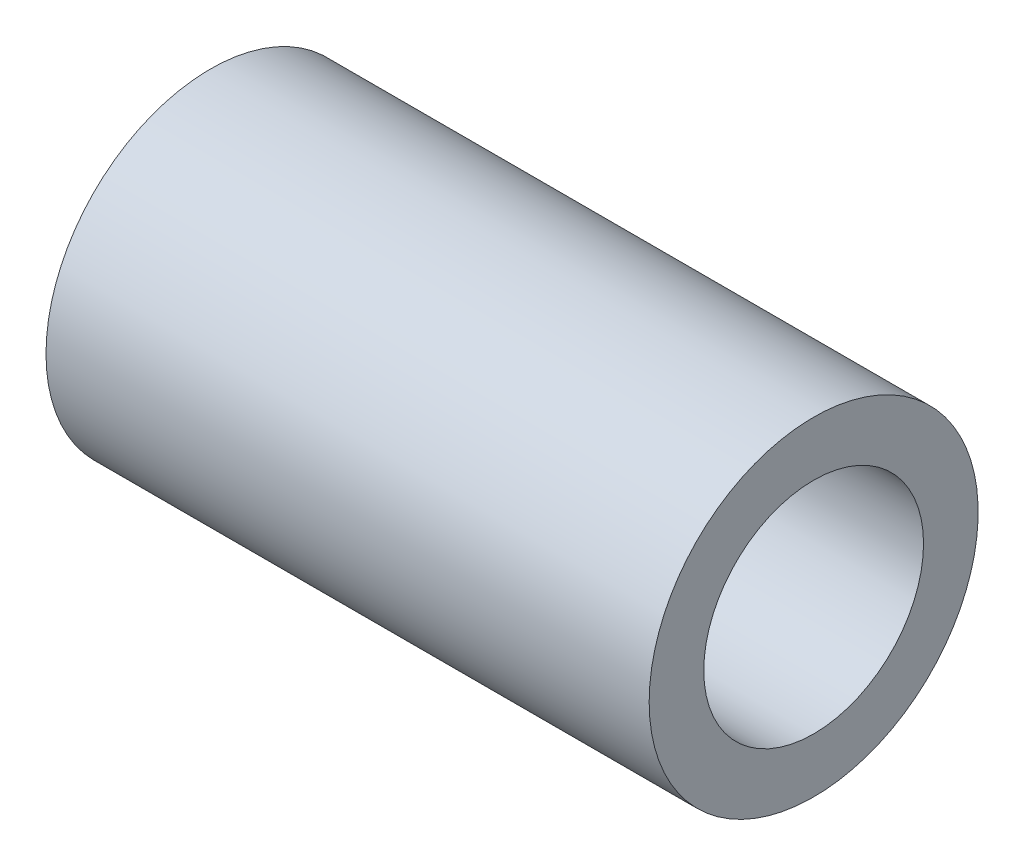
ISO-10303-21;
HEADER;
FILE_DESCRIPTION(('STEP AP214'),'2;1');
FILE_NAME('part.step','',(''),(''),'','','');
FILE_SCHEMA(('AUTOMOTIVE_DESIGN { 1 0 10303 214 1 1 1 1 }'));
ENDSEC;
DATA;
#1=APPLICATION_CONTEXT('core data for automotive mechanical design processes');
#2=APPLICATION_PROTOCOL_DEFINITION('international standard','automotive_design',2000,#1);
#3=PRODUCT_CONTEXT('',#1,'mechanical');
#4=PRODUCT('Part','Part','',(#3));
#5=PRODUCT_RELATED_PRODUCT_CATEGORY('part','',(#4));
#6=PRODUCT_DEFINITION_FORMATION('','',#4);
#7=PRODUCT_DEFINITION_CONTEXT('part definition',#1,'design');
#8=PRODUCT_DEFINITION('design','',#6,#7);
#9=PRODUCT_DEFINITION_SHAPE('','',#8);
#10=(LENGTH_UNIT() NAMED_UNIT(*) SI_UNIT(.MILLI.,.METRE.));
#11=(NAMED_UNIT(*) PLANE_ANGLE_UNIT() SI_UNIT($,.RADIAN.));
#12=(NAMED_UNIT(*) SI_UNIT($,.STERADIAN.) SOLID_ANGLE_UNIT());
#13=UNCERTAINTY_MEASURE_WITH_UNIT(LENGTH_MEASURE(1.E-05),#10,'distance_accuracy_value','');
#14=(GEOMETRIC_REPRESENTATION_CONTEXT(3) GLOBAL_UNCERTAINTY_ASSIGNED_CONTEXT((#13)) GLOBAL_UNIT_ASSIGNED_CONTEXT((#10,
#11,#12)) REPRESENTATION_CONTEXT('',''));
#15=CARTESIAN_POINT('',(0.,0.,0.));
#16=DIRECTION('',(0.,0.,1.));
#17=DIRECTION('',(1.,0.,0.));
#18=AXIS2_PLACEMENT_3D('',#15,#16,#17);
#19=CARTESIAN_POINT('',(0.,9.525,0.));
#20=DIRECTION('',(1.,0.,0.));
#21=DIRECTION('',(0.,0.,-1.));
#22=AXIS2_PLACEMENT_3D('',#19,#20,#21);
#23=PLANE('',#22);
#24=CARTESIAN_POINT('',(0.,0.,0.));
#25=DIRECTION('',(-1.,0.,0.));
#26=DIRECTION('',(0.,0.,1.));
#27=AXIS2_PLACEMENT_3D('',#24,#25,#26);
#28=CIRCLE('',#27,6.3627);
#29=CARTESIAN_POINT('',(0.,0.,6.3627));
#30=VERTEX_POINT('',#29);
#31=EDGE_CURVE('E10',#30,#30,#28,.T.);
#32=ORIENTED_EDGE('',*,*,#31,.F.);
#33=EDGE_LOOP('',(#32));
#34=FACE_BOUND('',#33,.T.);
#35=CARTESIAN_POINT('',(0.,0.,0.));
#36=DIRECTION('',(-1.,0.,0.));
#37=DIRECTION('',(0.,0.,1.));
#38=AXIS2_PLACEMENT_3D('',#35,#36,#37);
#39=CIRCLE('',#38,9.525);
#40=CARTESIAN_POINT('',(0.,0.,9.525));
#41=VERTEX_POINT('',#40);
#42=EDGE_CURVE('E36',#41,#41,#39,.T.);
#43=ORIENTED_EDGE('',*,*,#42,.T.);
#44=EDGE_LOOP('',(#43));
#45=FACE_BOUND('',#44,.T.);
#46=ADVANCED_FACE('F22',(#34,#45),#23,.F.);
#47=CARTESIAN_POINT('',(0.,0.,0.));
#48=DIRECTION('',(-1.,0.,0.));
#49=DIRECTION('',(0.,0.,1.));
#50=AXIS2_PLACEMENT_3D('',#47,#48,#49);
#51=CYLINDRICAL_SURFACE('',#50,6.3627);
#52=CARTESIAN_POINT('',(34.925,0.,0.));
#53=DIRECTION('',(-1.,0.,0.));
#54=DIRECTION('',(0.,0.,1.));
#55=AXIS2_PLACEMENT_3D('',#52,#53,#54);
#56=CIRCLE('',#55,6.3627);
#57=CARTESIAN_POINT('',(34.925,0.,6.3627));
#58=VERTEX_POINT('',#57);
#59=EDGE_CURVE('E28',#58,#58,#56,.T.);
#60=ORIENTED_EDGE('',*,*,#59,.F.);
#61=EDGE_LOOP('',(#60));
#62=FACE_BOUND('',#61,.T.);
#63=ORIENTED_EDGE('',*,*,#31,.T.);
#64=EDGE_LOOP('',(#63));
#65=FACE_BOUND('',#64,.T.);
#66=ADVANCED_FACE('F51',(#62,#65),#51,.F.);
#67=CARTESIAN_POINT('',(34.925,9.525,0.));
#68=DIRECTION('',(-1.,0.,0.));
#69=DIRECTION('',(0.,0.,1.));
#70=AXIS2_PLACEMENT_3D('',#67,#68,#69);
#71=PLANE('',#70);
#72=CARTESIAN_POINT('',(34.925,0.,0.));
#73=DIRECTION('',(-1.,0.,0.));
#74=DIRECTION('',(0.,0.,1.));
#75=AXIS2_PLACEMENT_3D('',#72,#73,#74);
#76=CIRCLE('',#75,9.525);
#77=CARTESIAN_POINT('',(34.925,0.,9.525));
#78=VERTEX_POINT('',#77);
#79=EDGE_CURVE('E32',#78,#78,#76,.T.);
#80=ORIENTED_EDGE('',*,*,#79,.F.);
#81=EDGE_LOOP('',(#80));
#82=FACE_BOUND('',#81,.T.);
#83=ORIENTED_EDGE('',*,*,#59,.T.);
#84=EDGE_LOOP('',(#83));
#85=FACE_BOUND('',#84,.T.);
#86=ADVANCED_FACE('F46',(#82,#85),#71,.F.);
#87=CARTESIAN_POINT('',(0.,0.,0.));
#88=DIRECTION('',(-1.,0.,0.));
#89=DIRECTION('',(0.,0.,1.));
#90=AXIS2_PLACEMENT_3D('',#87,#88,#89);
#91=CYLINDRICAL_SURFACE('',#90,9.525);
#92=ORIENTED_EDGE('',*,*,#42,.F.);
#93=EDGE_LOOP('',(#92));
#94=FACE_BOUND('',#93,.T.);
#95=ORIENTED_EDGE('',*,*,#79,.T.);
#96=EDGE_LOOP('',(#95));
#97=FACE_BOUND('',#96,.T.);
#98=ADVANCED_FACE('F43',(#94,#97),#91,.T.);
#99=CLOSED_SHELL('',(#46,#66,#86,#98));
#100=MANIFOLD_SOLID_BREP('B2',#99);
#101=ADVANCED_BREP_SHAPE_REPRESENTATION('',(#18,#100),#14);
#102=SHAPE_DEFINITION_REPRESENTATION(#9,#101);
ENDSEC;
END-ISO-10303-21;
